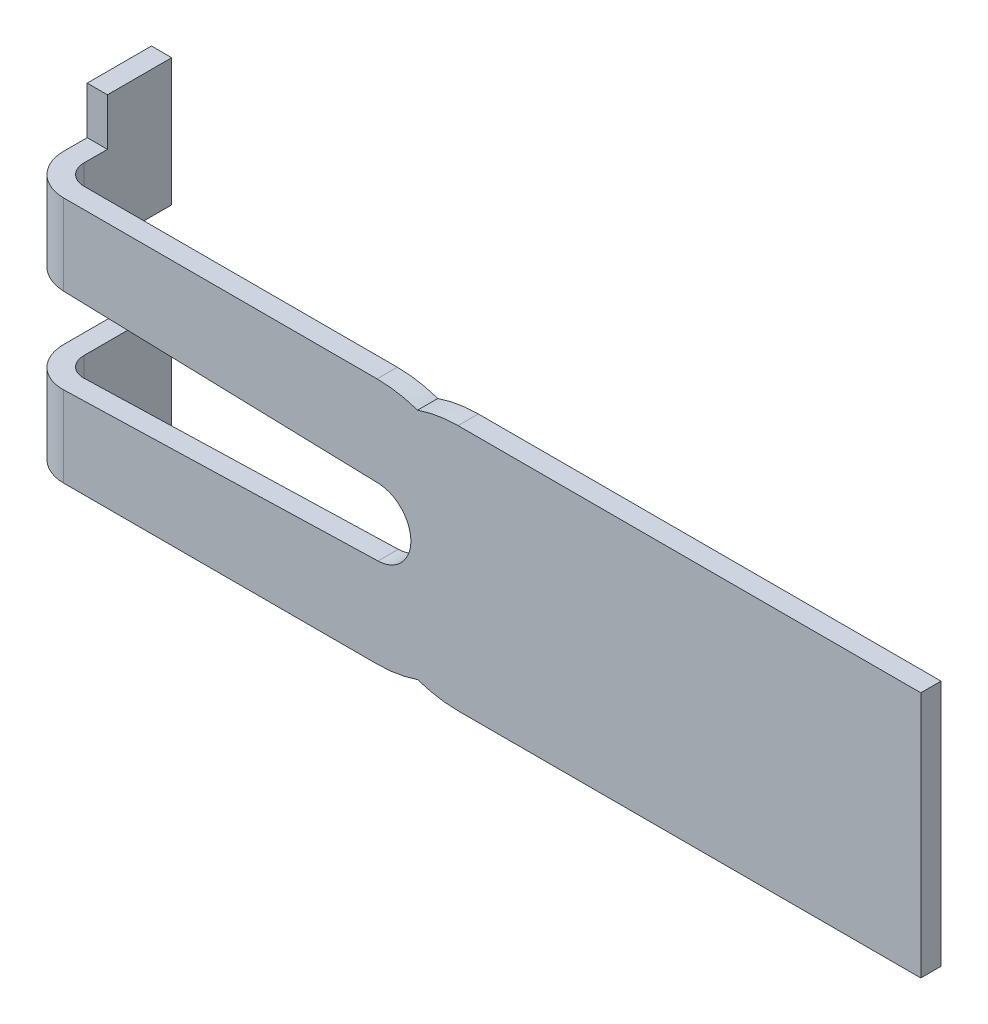
ISO-10303-21;
HEADER;
FILE_DESCRIPTION(('STEP AP214'),'2;1');
FILE_NAME('part.step','',(''),(''),'','','');
FILE_SCHEMA(('AUTOMOTIVE_DESIGN { 1 0 10303 214 1 1 1 1 }'));
ENDSEC;
DATA;
#1=APPLICATION_CONTEXT('core data for automotive mechanical design processes');
#2=APPLICATION_PROTOCOL_DEFINITION('international standard','automotive_design',2000,#1);
#3=PRODUCT_CONTEXT('',#1,'mechanical');
#4=PRODUCT('Part','Part','',(#3));
#5=PRODUCT_RELATED_PRODUCT_CATEGORY('part','',(#4));
#6=PRODUCT_DEFINITION_FORMATION('','',#4);
#7=PRODUCT_DEFINITION_CONTEXT('part definition',#1,'design');
#8=PRODUCT_DEFINITION('design','',#6,#7);
#9=PRODUCT_DEFINITION_SHAPE('','',#8);
#10=(LENGTH_UNIT() NAMED_UNIT(*) SI_UNIT(.MILLI.,.METRE.));
#11=(NAMED_UNIT(*) PLANE_ANGLE_UNIT() SI_UNIT($,.RADIAN.));
#12=(NAMED_UNIT(*) SI_UNIT($,.STERADIAN.) SOLID_ANGLE_UNIT());
#13=UNCERTAINTY_MEASURE_WITH_UNIT(LENGTH_MEASURE(1.E-05),#10,'distance_accuracy_value','');
#14=(GEOMETRIC_REPRESENTATION_CONTEXT(3) GLOBAL_UNCERTAINTY_ASSIGNED_CONTEXT((#13)) GLOBAL_UNIT_ASSIGNED_CONTEXT((#10,
#11,#12)) REPRESENTATION_CONTEXT('',''));
#15=CARTESIAN_POINT('',(0.,0.,0.));
#16=DIRECTION('',(0.,0.,1.));
#17=DIRECTION('',(1.,0.,0.));
#18=AXIS2_PLACEMENT_3D('',#15,#16,#17);
#19=CARTESIAN_POINT('',(0.300000000000002,1.83,1.9));
#20=DIRECTION('',(0.,0.,-1.));
#21=DIRECTION('',(-1.,0.,0.));
#22=AXIS2_PLACEMENT_3D('',#19,#20,#21);
#23=PLANE('',#22);
#24=CARTESIAN_POINT('',(6.14330650942758,0.,1.9));
#25=DIRECTION('',(0.,0.,-1.));
#26=DIRECTION('',(1.,0.,0.));
#27=AXIS2_PLACEMENT_3D('',#24,#25,#26);
#28=CIRCLE('',#27,1.83);
#29=CARTESIAN_POINT('',(6.14330650942758,-1.83,1.9));
#30=VERTEX_POINT('',#29);
#31=CARTESIAN_POINT('',(5.54330650942758,-1.72884354410687,1.9));
#32=VERTEX_POINT('',#31);
#33=EDGE_CURVE('E211',#30,#32,#28,.T.);
#34=ORIENTED_EDGE('',*,*,#33,.F.);
#35=DIRECTION('',(1.,0.,0.));
#36=VECTOR('',#35,1.);
#37=CARTESIAN_POINT('',(0.300000000000002,-1.83,1.9));
#38=LINE('',#37,#36);
#39=CARTESIAN_POINT('',(13.,-1.83,1.9));
#40=VERTEX_POINT('',#39);
#41=EDGE_CURVE('E444',#30,#40,#38,.T.);
#42=ORIENTED_EDGE('',*,*,#41,.T.);
#43=DIRECTION('',(0.,-1.,0.));
#44=VECTOR('',#43,1.);
#45=CARTESIAN_POINT('',(13.,1.83,1.9));
#46=LINE('',#45,#44);
#47=CARTESIAN_POINT('',(13.,1.83,1.9));
#48=VERTEX_POINT('',#47);
#49=EDGE_CURVE('E332',#48,#40,#46,.T.);
#50=ORIENTED_EDGE('',*,*,#49,.F.);
#51=DIRECTION('',(1.,0.,0.));
#52=VECTOR('',#51,1.);
#53=CARTESIAN_POINT('',(0.300000000000002,1.83,1.9));
#54=LINE('',#53,#52);
#55=CARTESIAN_POINT('',(6.14330650942758,1.83,1.9));
#56=VERTEX_POINT('',#55);
#57=EDGE_CURVE('E310',#56,#48,#54,.T.);
#58=ORIENTED_EDGE('',*,*,#57,.F.);
#59=CARTESIAN_POINT('',(6.14330650942758,0.,1.9));
#60=DIRECTION('',(0.,0.,-1.));
#61=DIRECTION('',(1.,0.,0.));
#62=AXIS2_PLACEMENT_3D('',#59,#60,#61);
#63=CIRCLE('',#62,1.83);
#64=CARTESIAN_POINT('',(5.54330650942758,1.72884354410687,1.9));
#65=VERTEX_POINT('',#64);
#66=EDGE_CURVE('E235',#65,#56,#63,.T.);
#67=ORIENTED_EDGE('',*,*,#66,.F.);
#68=CARTESIAN_POINT('',(4.94330650942758,0.,1.9));
#69=DIRECTION('',(0.,0.,-1.));
#70=DIRECTION('',(1.,0.,0.));
#71=AXIS2_PLACEMENT_3D('',#68,#69,#70);
#72=CIRCLE('',#71,1.83);
#73=CARTESIAN_POINT('',(4.94330650942758,1.83,1.9));
#74=VERTEX_POINT('',#73);
#75=EDGE_CURVE('E237',#74,#65,#72,.T.);
#76=ORIENTED_EDGE('',*,*,#75,.F.);
#77=CARTESIAN_POINT('',(0.300000000000002,1.83,1.9));
#78=VERTEX_POINT('',#77);
#79=EDGE_CURVE('E311',#78,#74,#54,.T.);
#80=ORIENTED_EDGE('',*,*,#79,.F.);
#81=DIRECTION('',(0.,-1.,0.));
#82=VECTOR('',#81,1.);
#83=CARTESIAN_POINT('',(0.300000000000002,1.83,1.9));
#84=LINE('',#83,#82);
#85=CARTESIAN_POINT('',(0.300000000000002,0.632858603308353,1.9));
#86=VERTEX_POINT('',#85);
#87=EDGE_CURVE('E358',#78,#86,#84,.T.);
#88=ORIENTED_EDGE('',*,*,#87,.T.);
#89=DIRECTION('',(-0.999592155917968,0.0285573427907472,0.));
#90=VECTOR('',#89,1.);
#91=CARTESIAN_POINT('',(-0.3,0.65,1.9));
#92=LINE('',#91,#90);
#93=CARTESIAN_POINT('',(4.95758518082296,0.499796077958984,1.9));
#94=VERTEX_POINT('',#93);
#95=EDGE_CURVE('E419',#94,#86,#92,.T.);
#96=ORIENTED_EDGE('',*,*,#95,.F.);
#97=CARTESIAN_POINT('',(4.94330650942758,0.,1.9));
#98=DIRECTION('',(0.,0.,1.));
#99=DIRECTION('',(1.,0.,0.));
#100=AXIS2_PLACEMENT_3D('',#97,#98,#99);
#101=CIRCLE('',#100,0.5);
#102=CARTESIAN_POINT('',(4.95758518082296,-0.499796077958984,1.9));
#103=VERTEX_POINT('',#102);
#104=EDGE_CURVE('E417',#103,#94,#101,.T.);
#105=ORIENTED_EDGE('',*,*,#104,.F.);
#106=DIRECTION('',(0.999592155917968,0.0285573427907472,0.));
#107=VECTOR('',#106,1.);
#108=CARTESIAN_POINT('',(-0.3,-0.65,1.9));
#109=LINE('',#108,#107);
#110=CARTESIAN_POINT('',(0.3,-0.632858603308353,1.9));
#111=VERTEX_POINT('',#110);
#112=EDGE_CURVE('E415',#111,#103,#109,.T.);
#113=ORIENTED_EDGE('',*,*,#112,.F.);
#114=CARTESIAN_POINT('',(0.300000000000002,-1.83,1.9));
#115=VERTEX_POINT('',#114);
#116=EDGE_CURVE('E360',#111,#115,#84,.T.);
#117=ORIENTED_EDGE('',*,*,#116,.T.);
#118=CARTESIAN_POINT('',(4.94330650942758,-1.83,1.9));
#119=VERTEX_POINT('',#118);
#120=EDGE_CURVE('E227',#115,#119,#38,.T.);
#121=ORIENTED_EDGE('',*,*,#120,.T.);
#122=CARTESIAN_POINT('',(4.94330650942758,0.,1.9));
#123=DIRECTION('',(0.,0.,-1.));
#124=DIRECTION('',(1.,0.,0.));
#125=AXIS2_PLACEMENT_3D('',#122,#123,#124);
#126=CIRCLE('',#125,1.83);
#127=EDGE_CURVE('E51',#32,#119,#126,.T.);
#128=ORIENTED_EDGE('',*,*,#127,.F.);
#129=EDGE_LOOP('',(#34,#42,#50,#58,#67,#76,#80,#88,#96,#105,#113,#117,#121,#128));
#130=FACE_BOUND('',#129,.T.);
#131=ADVANCED_FACE('F35',(#130),#23,.F.);
#132=CARTESIAN_POINT('',(0.300000000000002,1.83,1.6));
#133=DIRECTION('',(0.,0.,-1.));
#134=DIRECTION('',(-1.,0.,0.));
#135=AXIS2_PLACEMENT_3D('',#132,#133,#134);
#136=PLANE('',#135);
#137=DIRECTION('',(1.,0.,0.));
#138=VECTOR('',#137,1.);
#139=CARTESIAN_POINT('',(0.300000000000002,-1.83,1.6));
#140=LINE('',#139,#138);
#141=CARTESIAN_POINT('',(6.14330650942758,-1.83,1.6));
#142=VERTEX_POINT('',#141);
#143=CARTESIAN_POINT('',(13.,-1.83,1.6));
#144=VERTEX_POINT('',#143);
#145=EDGE_CURVE('E449',#142,#144,#140,.T.);
#146=ORIENTED_EDGE('',*,*,#145,.F.);
#147=CARTESIAN_POINT('',(6.14330650942758,0.,1.6));
#148=DIRECTION('',(0.,0.,-1.));
#149=DIRECTION('',(-1.,0.,0.));
#150=AXIS2_PLACEMENT_3D('',#147,#148,#149);
#151=CIRCLE('',#150,1.83);
#152=CARTESIAN_POINT('',(5.54330650942758,-1.72884354410687,1.6));
#153=VERTEX_POINT('',#152);
#154=EDGE_CURVE('E233',#142,#153,#151,.T.);
#155=ORIENTED_EDGE('',*,*,#154,.T.);
#156=CARTESIAN_POINT('',(4.94330650942758,0.,1.6));
#157=DIRECTION('',(0.,0.,-1.));
#158=DIRECTION('',(-1.,0.,0.));
#159=AXIS2_PLACEMENT_3D('',#156,#157,#158);
#160=CIRCLE('',#159,1.83);
#161=CARTESIAN_POINT('',(4.94330650942758,-1.83,1.6));
#162=VERTEX_POINT('',#161);
#163=EDGE_CURVE('E222',#153,#162,#160,.T.);
#164=ORIENTED_EDGE('',*,*,#163,.T.);
#165=CARTESIAN_POINT('',(0.300000000000002,-1.83,1.6));
#166=VERTEX_POINT('',#165);
#167=EDGE_CURVE('E450',#166,#162,#140,.T.);
#168=ORIENTED_EDGE('',*,*,#167,.F.);
#169=DIRECTION('',(0.,-1.,0.));
#170=VECTOR('',#169,1.);
#171=CARTESIAN_POINT('',(0.300000000000002,1.83,1.6));
#172=LINE('',#171,#170);
#173=CARTESIAN_POINT('',(0.300000000000002,-0.632858603308353,1.6));
#174=VERTEX_POINT('',#173);
#175=EDGE_CURVE('E341',#174,#166,#172,.T.);
#176=ORIENTED_EDGE('',*,*,#175,.F.);
#177=DIRECTION('',(0.999592155917968,0.0285573427907472,0.));
#178=VECTOR('',#177,1.);
#179=CARTESIAN_POINT('',(0.37030401260542,-0.63085008835988,1.6));
#180=LINE('',#179,#178);
#181=CARTESIAN_POINT('',(4.95758518082296,-0.499796077958984,1.6));
#182=VERTEX_POINT('',#181);
#183=EDGE_CURVE('E441',#174,#182,#180,.T.);
#184=ORIENTED_EDGE('',*,*,#183,.T.);
#185=CARTESIAN_POINT('',(4.94330650942758,0.,1.6));
#186=DIRECTION('',(0.,0.,-1.));
#187=DIRECTION('',(-1.,0.,0.));
#188=AXIS2_PLACEMENT_3D('',#185,#186,#187);
#189=CIRCLE('',#188,0.5);
#190=CARTESIAN_POINT('',(4.95758518082296,0.499796077958984,1.6));
#191=VERTEX_POINT('',#190);
#192=EDGE_CURVE('E11',#182,#191,#189,.F.);
#193=ORIENTED_EDGE('',*,*,#192,.T.);
#194=DIRECTION('',(-0.999592155917968,0.0285573427907472,0.));
#195=VECTOR('',#194,1.);
#196=CARTESIAN_POINT('',(0.265826765803601,0.633834898247682,1.6));
#197=LINE('',#196,#195);
#198=CARTESIAN_POINT('',(0.300000000000002,0.632858603308353,1.6));
#199=VERTEX_POINT('',#198);
#200=EDGE_CURVE('E386',#191,#199,#197,.T.);
#201=ORIENTED_EDGE('',*,*,#200,.T.);
#202=CARTESIAN_POINT('',(0.300000000000002,1.83,1.6));
#203=VERTEX_POINT('',#202);
#204=EDGE_CURVE('E338',#203,#199,#172,.T.);
#205=ORIENTED_EDGE('',*,*,#204,.F.);
#206=DIRECTION('',(1.,0.,0.));
#207=VECTOR('',#206,1.);
#208=CARTESIAN_POINT('',(0.300000000000002,1.83,1.6));
#209=LINE('',#208,#207);
#210=CARTESIAN_POINT('',(4.94330650942758,1.83,1.6));
#211=VERTEX_POINT('',#210);
#212=EDGE_CURVE('E318',#203,#211,#209,.T.);
#213=ORIENTED_EDGE('',*,*,#212,.T.);
#214=CARTESIAN_POINT('',(4.94330650942758,0.,1.6));
#215=DIRECTION('',(0.,0.,-1.));
#216=DIRECTION('',(-1.,0.,0.));
#217=AXIS2_PLACEMENT_3D('',#214,#215,#216);
#218=CIRCLE('',#217,1.83);
#219=CARTESIAN_POINT('',(5.54330650942758,1.72884354410687,1.6));
#220=VERTEX_POINT('',#219);
#221=EDGE_CURVE('E59',#211,#220,#218,.T.);
#222=ORIENTED_EDGE('',*,*,#221,.T.);
#223=CARTESIAN_POINT('',(6.14330650942758,0.,1.6));
#224=DIRECTION('',(0.,0.,-1.));
#225=DIRECTION('',(-1.,0.,0.));
#226=AXIS2_PLACEMENT_3D('',#223,#224,#225);
#227=CIRCLE('',#226,1.83);
#228=CARTESIAN_POINT('',(6.14330650942758,1.83,1.6));
#229=VERTEX_POINT('',#228);
#230=EDGE_CURVE('E246',#220,#229,#227,.T.);
#231=ORIENTED_EDGE('',*,*,#230,.T.);
#232=CARTESIAN_POINT('',(13.,1.83,1.6));
#233=VERTEX_POINT('',#232);
#234=EDGE_CURVE('E317',#229,#233,#209,.T.);
#235=ORIENTED_EDGE('',*,*,#234,.T.);
#236=DIRECTION('',(0.,-1.,0.));
#237=VECTOR('',#236,1.);
#238=CARTESIAN_POINT('',(13.,1.83,1.6));
#239=LINE('',#238,#237);
#240=EDGE_CURVE('E335',#233,#144,#239,.T.);
#241=ORIENTED_EDGE('',*,*,#240,.T.);
#242=EDGE_LOOP('',(#146,#155,#164,#168,#176,#184,#193,#201,#205,#213,#222,#231,#235,#241));
#243=FACE_BOUND('',#242,.T.);
#244=ADVANCED_FACE('F384',(#243),#136,.T.);
#245=CARTESIAN_POINT('',(0.3,-1.83,1.3));
#246=DIRECTION('',(0.,1.,0.));
#247=DIRECTION('',(0.,0.,1.));
#248=AXIS2_PLACEMENT_3D('',#245,#246,#247);
#249=PLANE('',#248);
#250=DIRECTION('',(0.,0.,-1.));
#251=VECTOR('',#250,1.);
#252=CARTESIAN_POINT('',(4.94330650942758,-1.83,1.9));
#253=LINE('',#252,#251);
#254=EDGE_CURVE('E223',#119,#162,#253,.T.);
#255=ORIENTED_EDGE('',*,*,#254,.F.);
#256=ORIENTED_EDGE('',*,*,#120,.F.);
#257=CARTESIAN_POINT('',(0.3,-1.83,1.3));
#258=DIRECTION('',(0.,1.,0.));
#259=DIRECTION('',(1.,0.,0.));
#260=AXIS2_PLACEMENT_3D('',#257,#258,#259);
#261=CIRCLE('',#260,0.6);
#262=CARTESIAN_POINT('',(-0.3,-1.83,1.3));
#263=VERTEX_POINT('',#262);
#264=EDGE_CURVE('E303',#263,#115,#261,.T.);
#265=ORIENTED_EDGE('',*,*,#264,.F.);
#266=DIRECTION('',(0.,0.,1.));
#267=VECTOR('',#266,1.);
#268=CARTESIAN_POINT('',(-0.3,-1.83,0.));
#269=LINE('',#268,#267);
#270=CARTESIAN_POINT('',(-0.3,-1.83,0.952232616032771));
#271=VERTEX_POINT('',#270);
#272=EDGE_CURVE('E301',#271,#263,#269,.T.);
#273=ORIENTED_EDGE('',*,*,#272,.F.);
#274=DIRECTION('',(1.,0.,0.));
#275=VECTOR('',#274,1.);
#276=CARTESIAN_POINT('',(0.,-1.83,0.952232616032771));
#277=LINE('',#276,#275);
#278=CARTESIAN_POINT('',(0.,-1.83,0.952232616032771));
#279=VERTEX_POINT('',#278);
#280=EDGE_CURVE('E249',#271,#279,#277,.T.);
#281=ORIENTED_EDGE('',*,*,#280,.T.);
#282=DIRECTION('',(0.,0.,1.));
#283=VECTOR('',#282,1.);
#284=CARTESIAN_POINT('',(0.,-1.83,0.));
#285=LINE('',#284,#283);
#286=CARTESIAN_POINT('',(0.,-1.83,1.3));
#287=VERTEX_POINT('',#286);
#288=EDGE_CURVE('E258',#279,#287,#285,.T.);
#289=ORIENTED_EDGE('',*,*,#288,.T.);
#290=CARTESIAN_POINT('',(0.3,-1.83,1.3));
#291=DIRECTION('',(0.,1.,0.));
#292=DIRECTION('',(0.,0.,-1.));
#293=AXIS2_PLACEMENT_3D('',#290,#291,#292);
#294=CIRCLE('',#293,0.3);
#295=EDGE_CURVE('E452',#287,#166,#294,.T.);
#296=ORIENTED_EDGE('',*,*,#295,.T.);
#297=ORIENTED_EDGE('',*,*,#167,.T.);
#298=EDGE_LOOP('',(#255,#256,#265,#273,#281,#289,#296,#297));
#299=FACE_BOUND('',#298,.T.);
#300=ADVANCED_FACE('F458',(#299),#249,.F.);
#301=CARTESIAN_POINT('',(0.3,1.83,1.3));
#302=DIRECTION('',(0.,1.,0.));
#303=DIRECTION('',(0.,0.,1.));
#304=AXIS2_PLACEMENT_3D('',#301,#302,#303);
#305=PLANE('',#304);
#306=ORIENTED_EDGE('',*,*,#79,.T.);
#307=DIRECTION('',(0.,0.,-1.));
#308=VECTOR('',#307,1.);
#309=CARTESIAN_POINT('',(4.94330650942758,1.83,1.9));
#310=LINE('',#309,#308);
#311=EDGE_CURVE('E241',#74,#211,#310,.T.);
#312=ORIENTED_EDGE('',*,*,#311,.T.);
#313=ORIENTED_EDGE('',*,*,#212,.F.);
#314=CARTESIAN_POINT('',(0.3,1.83,1.3));
#315=DIRECTION('',(0.,1.,0.));
#316=DIRECTION('',(0.,0.,-1.));
#317=AXIS2_PLACEMENT_3D('',#314,#315,#316);
#318=CIRCLE('',#317,0.3);
#319=CARTESIAN_POINT('',(0.,1.83,1.3));
#320=VERTEX_POINT('',#319);
#321=EDGE_CURVE('E321',#320,#203,#318,.T.);
#322=ORIENTED_EDGE('',*,*,#321,.F.);
#323=DIRECTION('',(0.,0.,1.));
#324=VECTOR('',#323,1.);
#325=CARTESIAN_POINT('',(0.,1.83,0.));
#326=LINE('',#325,#324);
#327=CARTESIAN_POINT('',(0.,1.83,0.952232616032771));
#328=VERTEX_POINT('',#327);
#329=EDGE_CURVE('E324',#328,#320,#326,.T.);
#330=ORIENTED_EDGE('',*,*,#329,.F.);
#331=DIRECTION('',(1.,0.,0.));
#332=VECTOR('',#331,1.);
#333=CARTESIAN_POINT('',(0.,1.83,0.952232616032771));
#334=LINE('',#333,#332);
#335=CARTESIAN_POINT('',(-0.3,1.83,0.952232616032771));
#336=VERTEX_POINT('',#335);
#337=EDGE_CURVE('E263',#336,#328,#334,.T.);
#338=ORIENTED_EDGE('',*,*,#337,.F.);
#339=DIRECTION('',(0.,0.,1.));
#340=VECTOR('',#339,1.);
#341=CARTESIAN_POINT('',(-0.3,1.83,0.));
#342=LINE('',#341,#340);
#343=CARTESIAN_POINT('',(-0.3,1.83,1.3));
#344=VERTEX_POINT('',#343);
#345=EDGE_CURVE('E287',#336,#344,#342,.T.);
#346=ORIENTED_EDGE('',*,*,#345,.T.);
#347=CARTESIAN_POINT('',(0.3,1.83,1.3));
#348=DIRECTION('',(0.,1.,0.));
#349=DIRECTION('',(1.,0.,0.));
#350=AXIS2_PLACEMENT_3D('',#347,#348,#349);
#351=CIRCLE('',#350,0.6);
#352=EDGE_CURVE('E361',#344,#78,#351,.T.);
#353=ORIENTED_EDGE('',*,*,#352,.T.);
#354=EDGE_LOOP('',(#306,#312,#313,#322,#330,#338,#346,#353));
#355=FACE_BOUND('',#354,.T.);
#356=ADVANCED_FACE('F367',(#355),#305,.T.);
#357=CARTESIAN_POINT('',(0.3,1.83,1.3));
#358=DIRECTION('',(0.,-1.,0.));
#359=DIRECTION('',(0.,0.,-1.));
#360=AXIS2_PLACEMENT_3D('',#357,#358,#359);
#361=CYLINDRICAL_SURFACE('',#360,0.3);
#362=DIRECTION('',(0.,-1.,0.));
#363=VECTOR('',#362,1.);
#364=CARTESIAN_POINT('',(0.,1.83,1.3));
#365=LINE('',#364,#363);
#366=CARTESIAN_POINT('',(0.,-0.641429301654177,1.3));
#367=VERTEX_POINT('',#366);
#368=EDGE_CURVE('E345',#367,#287,#365,.T.);
#369=ORIENTED_EDGE('',*,*,#368,.F.);
#370=CARTESIAN_POINT('',(0.3,-0.632858603308353,1.3));
#371=DIRECTION('',(-0.0285573427907472,0.999592155917968,0.));
#372=DIRECTION('',(-0.999592155917968,-0.0285573427907472,0.));
#373=AXIS2_PLACEMENT_3D('',#370,#371,#372);
#374=ELLIPSE('',#373,0.300122403146008,0.3);
#375=EDGE_CURVE('E438',#367,#174,#374,.T.);
#376=ORIENTED_EDGE('',*,*,#375,.T.);
#377=ORIENTED_EDGE('',*,*,#175,.T.);
#378=ORIENTED_EDGE('',*,*,#295,.F.);
#379=EDGE_LOOP('',(#369,#376,#377,#378));
#380=FACE_BOUND('',#379,.T.);
#381=ADVANCED_FACE('F465',(#380),#361,.F.);
#382=ORIENTED_EDGE('',*,*,#204,.T.);
#383=CARTESIAN_POINT('',(0.3,0.632858603308353,1.3));
#384=DIRECTION('',(-0.0285573427907472,-0.999592155917968,0.));
#385=DIRECTION('',(0.999592155917968,-0.0285573427907472,0.));
#386=AXIS2_PLACEMENT_3D('',#383,#384,#385);
#387=ELLIPSE('',#386,0.300122403146008,0.3);
#388=CARTESIAN_POINT('',(0.,0.641429301654177,1.3));
#389=VERTEX_POINT('',#388);
#390=EDGE_CURVE('E391',#199,#389,#387,.T.);
#391=ORIENTED_EDGE('',*,*,#390,.T.);
#392=EDGE_CURVE('E342',#320,#389,#365,.T.);
#393=ORIENTED_EDGE('',*,*,#392,.F.);
#394=ORIENTED_EDGE('',*,*,#321,.T.);
#395=EDGE_LOOP('',(#382,#391,#393,#394));
#396=FACE_BOUND('',#395,.T.);
#397=ADVANCED_FACE('F389',(#396),#361,.F.);
#398=CARTESIAN_POINT('',(0.,1.83,0.));
#399=DIRECTION('',(1.,0.,0.));
#400=DIRECTION('',(0.,0.,-1.));
#401=AXIS2_PLACEMENT_3D('',#398,#399,#400);
#402=PLANE('',#401);
#403=DIRECTION('',(0.,-1.,0.));
#404=VECTOR('',#403,1.);
#405=CARTESIAN_POINT('',(0.,1.83,0.));
#406=LINE('',#405,#404);
#407=CARTESIAN_POINT('',(0.,-0.641429301654177,0.));
#408=VERTEX_POINT('',#407);
#409=CARTESIAN_POINT('',(0.,-2.53,0.));
#410=VERTEX_POINT('',#409);
#411=EDGE_CURVE('E349',#408,#410,#406,.T.);
#412=ORIENTED_EDGE('',*,*,#411,.F.);
#413=DIRECTION('',(0.,0.,1.));
#414=VECTOR('',#413,1.);
#415=CARTESIAN_POINT('',(0.,-0.641429301654177,0.));
#416=LINE('',#415,#414);
#417=EDGE_CURVE('E435',#408,#367,#416,.T.);
#418=ORIENTED_EDGE('',*,*,#417,.T.);
#419=ORIENTED_EDGE('',*,*,#368,.T.);
#420=ORIENTED_EDGE('',*,*,#288,.F.);
#421=DIRECTION('',(0.,1.,0.));
#422=VECTOR('',#421,1.);
#423=CARTESIAN_POINT('',(0.,-2.53,0.952232616032771));
#424=LINE('',#423,#422);
#425=CARTESIAN_POINT('',(0.,-2.53,0.952232616032771));
#426=VERTEX_POINT('',#425);
#427=EDGE_CURVE('E261',#426,#279,#424,.T.);
#428=ORIENTED_EDGE('',*,*,#427,.F.);
#429=DIRECTION('',(0.,0.,-1.));
#430=VECTOR('',#429,1.);
#431=CARTESIAN_POINT('',(0.,-2.53,0.));
#432=LINE('',#431,#430);
#433=EDGE_CURVE('E252',#426,#410,#432,.T.);
#434=ORIENTED_EDGE('',*,*,#433,.T.);
#435=EDGE_LOOP('',(#412,#418,#419,#420,#428,#434));
#436=FACE_BOUND('',#435,.T.);
#437=ADVANCED_FACE('F463',(#436),#402,.T.);
#438=ORIENTED_EDGE('',*,*,#392,.T.);
#439=DIRECTION('',(0.,0.,-1.));
#440=VECTOR('',#439,1.);
#441=CARTESIAN_POINT('',(0.,0.641429301654177,0.));
#442=LINE('',#441,#440);
#443=CARTESIAN_POINT('',(0.,0.641429301654177,0.));
#444=VERTEX_POINT('',#443);
#445=EDGE_CURVE('E431',#389,#444,#442,.T.);
#446=ORIENTED_EDGE('',*,*,#445,.T.);
#447=CARTESIAN_POINT('',(0.,2.53,0.));
#448=VERTEX_POINT('',#447);
#449=EDGE_CURVE('E346',#448,#444,#406,.T.);
#450=ORIENTED_EDGE('',*,*,#449,.F.);
#451=DIRECTION('',(0.,0.,-1.));
#452=VECTOR('',#451,1.);
#453=CARTESIAN_POINT('',(0.,2.53,0.));
#454=LINE('',#453,#452);
#455=CARTESIAN_POINT('',(0.,2.53,0.952232616032771));
#456=VERTEX_POINT('',#455);
#457=EDGE_CURVE('E281',#456,#448,#454,.T.);
#458=ORIENTED_EDGE('',*,*,#457,.F.);
#459=DIRECTION('',(0.,-1.,0.));
#460=VECTOR('',#459,1.);
#461=CARTESIAN_POINT('',(0.,2.53,0.952232616032771));
#462=LINE('',#461,#460);
#463=EDGE_CURVE('E290',#456,#328,#462,.T.);
#464=ORIENTED_EDGE('',*,*,#463,.T.);
#465=ORIENTED_EDGE('',*,*,#329,.T.);
#466=EDGE_LOOP('',(#438,#446,#450,#458,#464,#465));
#467=FACE_BOUND('',#466,.T.);
#468=ADVANCED_FACE('F398',(#467),#402,.T.);
#469=CARTESIAN_POINT('',(-0.3,1.83,0.));
#470=DIRECTION('',(0.,0.,-1.));
#471=DIRECTION('',(-1.,0.,0.));
#472=AXIS2_PLACEMENT_3D('',#469,#470,#471);
#473=PLANE('',#472);
#474=DIRECTION('',(0.,-1.,0.));
#475=VECTOR('',#474,1.);
#476=CARTESIAN_POINT('',(-0.3,1.83,0.));
#477=LINE('',#476,#475);
#478=CARTESIAN_POINT('',(-0.3,-0.65,0.));
#479=VERTEX_POINT('',#478);
#480=CARTESIAN_POINT('',(-0.3,-2.53,0.));
#481=VERTEX_POINT('',#480);
#482=EDGE_CURVE('E353',#479,#481,#477,.T.);
#483=ORIENTED_EDGE('',*,*,#482,.F.);
#484=DIRECTION('',(0.999592155917968,0.0285573427907472,0.));
#485=VECTOR('',#484,1.);
#486=CARTESIAN_POINT('',(-0.3,-0.65,0.));
#487=LINE('',#486,#485);
#488=EDGE_CURVE('E299',#479,#408,#487,.T.);
#489=ORIENTED_EDGE('',*,*,#488,.T.);
#490=ORIENTED_EDGE('',*,*,#411,.T.);
#491=DIRECTION('',(-1.,0.,0.));
#492=VECTOR('',#491,1.);
#493=CARTESIAN_POINT('',(0.,-2.53,0.));
#494=LINE('',#493,#492);
#495=EDGE_CURVE('E266',#410,#481,#494,.T.);
#496=ORIENTED_EDGE('',*,*,#495,.T.);
#497=EDGE_LOOP('',(#483,#489,#490,#496));
#498=FACE_BOUND('',#497,.T.);
#499=ADVANCED_FACE('F478',(#498),#473,.T.);
#500=ORIENTED_EDGE('',*,*,#449,.T.);
#501=DIRECTION('',(-0.999592155917968,0.0285573427907472,0.));
#502=VECTOR('',#501,1.);
#503=CARTESIAN_POINT('',(-0.3,0.65,0.));
#504=LINE('',#503,#502);
#505=CARTESIAN_POINT('',(-0.3,0.65,0.));
#506=VERTEX_POINT('',#505);
#507=EDGE_CURVE('E412',#444,#506,#504,.T.);
#508=ORIENTED_EDGE('',*,*,#507,.T.);
#509=CARTESIAN_POINT('',(-0.3,2.53,0.));
#510=VERTEX_POINT('',#509);
#511=EDGE_CURVE('E350',#510,#506,#477,.T.);
#512=ORIENTED_EDGE('',*,*,#511,.F.);
#513=DIRECTION('',(-1.,0.,0.));
#514=VECTOR('',#513,1.);
#515=CARTESIAN_POINT('',(0.,2.53,0.));
#516=LINE('',#515,#514);
#517=EDGE_CURVE('E404',#448,#510,#516,.T.);
#518=ORIENTED_EDGE('',*,*,#517,.F.);
#519=EDGE_LOOP('',(#500,#508,#512,#518));
#520=FACE_BOUND('',#519,.T.);
#521=ADVANCED_FACE('F665',(#520),#473,.T.);
#522=CARTESIAN_POINT('',(-0.3,1.83,0.));
#523=DIRECTION('',(1.,0.,0.));
#524=DIRECTION('',(0.,0.,-1.));
#525=AXIS2_PLACEMENT_3D('',#522,#523,#524);
#526=PLANE('',#525);
#527=DIRECTION('',(0.,0.,-1.));
#528=VECTOR('',#527,1.);
#529=CARTESIAN_POINT('',(-0.3,-0.65,1.9));
#530=LINE('',#529,#528);
#531=CARTESIAN_POINT('',(-0.3,-0.65,1.3));
#532=VERTEX_POINT('',#531);
#533=EDGE_CURVE('E428',#532,#479,#530,.T.);
#534=ORIENTED_EDGE('',*,*,#533,.T.);
#535=ORIENTED_EDGE('',*,*,#482,.T.);
#536=DIRECTION('',(0.,0.,1.));
#537=VECTOR('',#536,1.);
#538=CARTESIAN_POINT('',(-0.3,-2.53,0.));
#539=LINE('',#538,#537);
#540=CARTESIAN_POINT('',(-0.3,-2.53,0.952232616032771));
#541=VERTEX_POINT('',#540);
#542=EDGE_CURVE('E271',#481,#541,#539,.T.);
#543=ORIENTED_EDGE('',*,*,#542,.T.);
#544=DIRECTION('',(0.,1.,0.));
#545=VECTOR('',#544,1.);
#546=CARTESIAN_POINT('',(-0.3,-2.53,0.952232616032771));
#547=LINE('',#546,#545);
#548=EDGE_CURVE('E264',#541,#271,#547,.T.);
#549=ORIENTED_EDGE('',*,*,#548,.T.);
#550=ORIENTED_EDGE('',*,*,#272,.T.);
#551=DIRECTION('',(0.,-1.,0.));
#552=VECTOR('',#551,1.);
#553=CARTESIAN_POINT('',(-0.3,1.83,1.3));
#554=LINE('',#553,#552);
#555=EDGE_CURVE('E357',#532,#263,#554,.T.);
#556=ORIENTED_EDGE('',*,*,#555,.F.);
#557=EDGE_LOOP('',(#534,#535,#543,#549,#550,#556));
#558=FACE_BOUND('',#557,.T.);
#559=ADVANCED_FACE('F475',(#558),#526,.F.);
#560=DIRECTION('',(0.,0.,-1.));
#561=VECTOR('',#560,1.);
#562=CARTESIAN_POINT('',(-0.3,0.65,1.9));
#563=LINE('',#562,#561);
#564=CARTESIAN_POINT('',(-0.3,0.65,1.3));
#565=VERTEX_POINT('',#564);
#566=EDGE_CURVE('E372',#565,#506,#563,.T.);
#567=ORIENTED_EDGE('',*,*,#566,.F.);
#568=EDGE_CURVE('E354',#344,#565,#554,.T.);
#569=ORIENTED_EDGE('',*,*,#568,.F.);
#570=ORIENTED_EDGE('',*,*,#345,.F.);
#571=DIRECTION('',(0.,-1.,0.));
#572=VECTOR('',#571,1.);
#573=CARTESIAN_POINT('',(-0.3,2.53,0.952232616032771));
#574=LINE('',#573,#572);
#575=CARTESIAN_POINT('',(-0.3,2.53,0.952232616032771));
#576=VERTEX_POINT('',#575);
#577=EDGE_CURVE('E293',#576,#336,#574,.T.);
#578=ORIENTED_EDGE('',*,*,#577,.F.);
#579=DIRECTION('',(0.,0.,1.));
#580=VECTOR('',#579,1.);
#581=CARTESIAN_POINT('',(-0.3,2.53,0.));
#582=LINE('',#581,#580);
#583=EDGE_CURVE('E405',#510,#576,#582,.T.);
#584=ORIENTED_EDGE('',*,*,#583,.F.);
#585=ORIENTED_EDGE('',*,*,#511,.T.);
#586=EDGE_LOOP('',(#567,#569,#570,#578,#584,#585));
#587=FACE_BOUND('',#586,.T.);
#588=ADVANCED_FACE('F371',(#587),#526,.F.);
#589=CARTESIAN_POINT('',(0.3,1.83,1.3));
#590=DIRECTION('',(0.,-1.,0.));
#591=DIRECTION('',(0.,0.,-1.));
#592=AXIS2_PLACEMENT_3D('',#589,#590,#591);
#593=CYLINDRICAL_SURFACE('',#592,0.6);
#594=CARTESIAN_POINT('',(0.3,-0.632858603308353,1.3));
#595=DIRECTION('',(-0.0285573427907472,0.999592155917968,0.));
#596=DIRECTION('',(-0.999592155917968,-0.0285573427907472,0.));
#597=AXIS2_PLACEMENT_3D('',#594,#595,#596);
#598=ELLIPSE('',#597,0.600244806292016,0.6);
#599=EDGE_CURVE('E43',#532,#111,#598,.T.);
#600=ORIENTED_EDGE('',*,*,#599,.F.);
#601=ORIENTED_EDGE('',*,*,#555,.T.);
#602=ORIENTED_EDGE('',*,*,#264,.T.);
#603=ORIENTED_EDGE('',*,*,#116,.F.);
#604=EDGE_LOOP('',(#600,#601,#602,#603));
#605=FACE_BOUND('',#604,.T.);
#606=ADVANCED_FACE('F473',(#605),#593,.T.);
#607=CARTESIAN_POINT('',(0.3,0.632858603308353,1.3));
#608=DIRECTION('',(-0.0285573427907472,-0.999592155917968,0.));
#609=DIRECTION('',(0.999592155917968,-0.0285573427907472,0.));
#610=AXIS2_PLACEMENT_3D('',#607,#608,#609);
#611=ELLIPSE('',#610,0.600244806292016,0.6);
#612=EDGE_CURVE('E330',#86,#565,#611,.T.);
#613=ORIENTED_EDGE('',*,*,#612,.F.);
#614=ORIENTED_EDGE('',*,*,#87,.F.);
#615=ORIENTED_EDGE('',*,*,#352,.F.);
#616=ORIENTED_EDGE('',*,*,#568,.T.);
#617=EDGE_LOOP('',(#613,#614,#615,#616));
#618=FACE_BOUND('',#617,.T.);
#619=ADVANCED_FACE('F375',(#618),#593,.T.);
#620=CARTESIAN_POINT('',(13.,1.83,1.6));
#621=DIRECTION('',(1.,0.,0.));
#622=DIRECTION('',(0.,0.,-1.));
#623=AXIS2_PLACEMENT_3D('',#620,#621,#622);
#624=PLANE('',#623);
#625=DIRECTION('',(0.,0.,1.));
#626=VECTOR('',#625,1.);
#627=CARTESIAN_POINT('',(13.,-1.83,1.6));
#628=LINE('',#627,#626);
#629=EDGE_CURVE('E446',#144,#40,#628,.T.);
#630=ORIENTED_EDGE('',*,*,#629,.F.);
#631=ORIENTED_EDGE('',*,*,#240,.F.);
#632=DIRECTION('',(0.,0.,1.));
#633=VECTOR('',#632,1.);
#634=CARTESIAN_POINT('',(13.,1.83,1.6));
#635=LINE('',#634,#633);
#636=EDGE_CURVE('E314',#233,#48,#635,.T.);
#637=ORIENTED_EDGE('',*,*,#636,.T.);
#638=ORIENTED_EDGE('',*,*,#49,.T.);
#639=EDGE_LOOP('',(#630,#631,#637,#638));
#640=FACE_BOUND('',#639,.T.);
#641=ADVANCED_FACE('F509',(#640),#624,.T.);
#642=DIRECTION('',(0.,0.,-1.));
#643=VECTOR('',#642,1.);
#644=CARTESIAN_POINT('',(6.14330650942758,1.83,1.9));
#645=LINE('',#644,#643);
#646=EDGE_CURVE('E243',#56,#229,#645,.T.);
#647=ORIENTED_EDGE('',*,*,#646,.F.);
#648=ORIENTED_EDGE('',*,*,#57,.T.);
#649=ORIENTED_EDGE('',*,*,#636,.F.);
#650=ORIENTED_EDGE('',*,*,#234,.F.);
#651=EDGE_LOOP('',(#647,#648,#649,#650));
#652=FACE_BOUND('',#651,.T.);
#653=ADVANCED_FACE('F511',(#652),#305,.T.);
#654=ORIENTED_EDGE('',*,*,#41,.F.);
#655=DIRECTION('',(0.,0.,-1.));
#656=VECTOR('',#655,1.);
#657=CARTESIAN_POINT('',(6.14330650942758,-1.83,1.9));
#658=LINE('',#657,#656);
#659=EDGE_CURVE('E216',#30,#142,#658,.T.);
#660=ORIENTED_EDGE('',*,*,#659,.T.);
#661=ORIENTED_EDGE('',*,*,#145,.T.);
#662=ORIENTED_EDGE('',*,*,#629,.T.);
#663=EDGE_LOOP('',(#654,#660,#661,#662));
#664=FACE_BOUND('',#663,.T.);
#665=ADVANCED_FACE('F506',(#664),#249,.F.);
#666=CARTESIAN_POINT('',(-0.3,-0.65,1.9));
#667=DIRECTION('',(-0.0285573427907472,0.999592155917968,0.));
#668=DIRECTION('',(-0.999592155917968,-0.0285573427907472,0.));
#669=AXIS2_PLACEMENT_3D('',#666,#667,#668);
#670=PLANE('',#669);
#671=ORIENTED_EDGE('',*,*,#375,.F.);
#672=ORIENTED_EDGE('',*,*,#417,.F.);
#673=ORIENTED_EDGE('',*,*,#488,.F.);
#674=ORIENTED_EDGE('',*,*,#533,.F.);
#675=ORIENTED_EDGE('',*,*,#599,.T.);
#676=ORIENTED_EDGE('',*,*,#112,.T.);
#677=DIRECTION('',(0.,0.,-1.));
#678=VECTOR('',#677,1.);
#679=CARTESIAN_POINT('',(4.95758518082296,-0.499796077958984,1.9));
#680=LINE('',#679,#678);
#681=EDGE_CURVE('E425',#103,#182,#680,.T.);
#682=ORIENTED_EDGE('',*,*,#681,.T.);
#683=ORIENTED_EDGE('',*,*,#183,.F.);
#684=EDGE_LOOP('',(#671,#672,#673,#674,#675,#676,#682,#683));
#685=FACE_BOUND('',#684,.T.);
#686=ADVANCED_FACE('F607',(#685),#670,.T.);
#687=CARTESIAN_POINT('',(-0.3,0.65,1.9));
#688=DIRECTION('',(-0.0285573427907472,-0.999592155917968,0.));
#689=DIRECTION('',(0.999592155917968,-0.0285573427907472,0.));
#690=AXIS2_PLACEMENT_3D('',#687,#688,#689);
#691=PLANE('',#690);
#692=DIRECTION('',(0.,0.,-1.));
#693=VECTOR('',#692,1.);
#694=CARTESIAN_POINT('',(4.95758518082296,0.499796077958984,1.9));
#695=LINE('',#694,#693);
#696=EDGE_CURVE('E422',#94,#191,#695,.T.);
#697=ORIENTED_EDGE('',*,*,#696,.F.);
#698=ORIENTED_EDGE('',*,*,#95,.T.);
#699=ORIENTED_EDGE('',*,*,#612,.T.);
#700=ORIENTED_EDGE('',*,*,#566,.T.);
#701=ORIENTED_EDGE('',*,*,#507,.F.);
#702=ORIENTED_EDGE('',*,*,#445,.F.);
#703=ORIENTED_EDGE('',*,*,#390,.F.);
#704=ORIENTED_EDGE('',*,*,#200,.F.);
#705=EDGE_LOOP('',(#697,#698,#699,#700,#701,#702,#703,#704));
#706=FACE_BOUND('',#705,.T.);
#707=ADVANCED_FACE('F596',(#706),#691,.T.);
#708=CARTESIAN_POINT('',(4.94330650942758,0.,1.9));
#709=DIRECTION('',(0.,0.,-1.));
#710=DIRECTION('',(-1.,0.,0.));
#711=AXIS2_PLACEMENT_3D('',#708,#709,#710);
#712=CYLINDRICAL_SURFACE('',#711,0.5);
#713=ORIENTED_EDGE('',*,*,#681,.F.);
#714=ORIENTED_EDGE('',*,*,#104,.T.);
#715=ORIENTED_EDGE('',*,*,#696,.T.);
#716=ORIENTED_EDGE('',*,*,#192,.F.);
#717=EDGE_LOOP('',(#713,#714,#715,#716));
#718=FACE_BOUND('',#717,.T.);
#719=ADVANCED_FACE('F586',(#718),#712,.F.);
#720=CARTESIAN_POINT('',(0.,2.53,0.952232616032771));
#721=DIRECTION('',(0.,0.,-1.));
#722=DIRECTION('',(-1.,0.,0.));
#723=AXIS2_PLACEMENT_3D('',#720,#721,#722);
#724=PLANE('',#723);
#725=ORIENTED_EDGE('',*,*,#337,.T.);
#726=ORIENTED_EDGE('',*,*,#463,.F.);
#727=DIRECTION('',(1.,0.,0.));
#728=VECTOR('',#727,1.);
#729=CARTESIAN_POINT('',(0.,2.53,0.952232616032771));
#730=LINE('',#729,#728);
#731=EDGE_CURVE('E294',#576,#456,#730,.T.);
#732=ORIENTED_EDGE('',*,*,#731,.F.);
#733=ORIENTED_EDGE('',*,*,#577,.T.);
#734=EDGE_LOOP('',(#725,#726,#732,#733));
#735=FACE_BOUND('',#734,.T.);
#736=ADVANCED_FACE('F395',(#735),#724,.F.);
#737=CARTESIAN_POINT('',(0.,2.53,0.));
#738=DIRECTION('',(0.,-1.,0.));
#739=DIRECTION('',(0.,0.,-1.));
#740=AXIS2_PLACEMENT_3D('',#737,#738,#739);
#741=PLANE('',#740);
#742=ORIENTED_EDGE('',*,*,#457,.T.);
#743=ORIENTED_EDGE('',*,*,#517,.T.);
#744=ORIENTED_EDGE('',*,*,#583,.T.);
#745=ORIENTED_EDGE('',*,*,#731,.T.);
#746=EDGE_LOOP('',(#742,#743,#744,#745));
#747=FACE_BOUND('',#746,.T.);
#748=ADVANCED_FACE('F488',(#747),#741,.F.);
#749=CARTESIAN_POINT('',(0.,-2.53,0.952232616032771));
#750=DIRECTION('',(0.,0.,1.));
#751=DIRECTION('',(1.,0.,0.));
#752=AXIS2_PLACEMENT_3D('',#749,#750,#751);
#753=PLANE('',#752);
#754=ORIENTED_EDGE('',*,*,#280,.F.);
#755=ORIENTED_EDGE('',*,*,#548,.F.);
#756=DIRECTION('',(1.,0.,0.));
#757=VECTOR('',#756,1.);
#758=CARTESIAN_POINT('',(0.,-2.53,0.952232616032771));
#759=LINE('',#758,#757);
#760=EDGE_CURVE('E276',#541,#426,#759,.T.);
#761=ORIENTED_EDGE('',*,*,#760,.T.);
#762=ORIENTED_EDGE('',*,*,#427,.T.);
#763=EDGE_LOOP('',(#754,#755,#761,#762));
#764=FACE_BOUND('',#763,.T.);
#765=ADVANCED_FACE('F486',(#764),#753,.T.);
#766=CARTESIAN_POINT('',(0.,-2.53,0.));
#767=DIRECTION('',(0.,1.,0.));
#768=DIRECTION('',(0.,0.,-1.));
#769=AXIS2_PLACEMENT_3D('',#766,#767,#768);
#770=PLANE('',#769);
#771=ORIENTED_EDGE('',*,*,#433,.F.);
#772=ORIENTED_EDGE('',*,*,#760,.F.);
#773=ORIENTED_EDGE('',*,*,#542,.F.);
#774=ORIENTED_EDGE('',*,*,#495,.F.);
#775=EDGE_LOOP('',(#771,#772,#773,#774));
#776=FACE_BOUND('',#775,.T.);
#777=ADVANCED_FACE('F484',(#776),#770,.F.);
#778=CARTESIAN_POINT('',(6.14330650942758,0.,1.9));
#779=DIRECTION('',(0.,0.,-1.));
#780=DIRECTION('',(-1.,0.,0.));
#781=AXIS2_PLACEMENT_3D('',#778,#779,#780);
#782=CYLINDRICAL_SURFACE('',#781,1.83);
#783=DIRECTION('',(0.,0.,-1.));
#784=VECTOR('',#783,1.);
#785=CARTESIAN_POINT('',(5.54330650942758,1.72884354410687,1.9));
#786=LINE('',#785,#784);
#787=EDGE_CURVE('E239',#65,#220,#786,.T.);
#788=ORIENTED_EDGE('',*,*,#787,.F.);
#789=ORIENTED_EDGE('',*,*,#66,.T.);
#790=ORIENTED_EDGE('',*,*,#646,.T.);
#791=ORIENTED_EDGE('',*,*,#230,.F.);
#792=EDGE_LOOP('',(#788,#789,#790,#791));
#793=FACE_BOUND('',#792,.T.);
#794=ADVANCED_FACE('F494',(#793),#782,.T.);
#795=CARTESIAN_POINT('',(4.94330650942758,0.,1.9));
#796=DIRECTION('',(0.,0.,-1.));
#797=DIRECTION('',(-1.,0.,0.));
#798=AXIS2_PLACEMENT_3D('',#795,#796,#797);
#799=CYLINDRICAL_SURFACE('',#798,1.83);
#800=ORIENTED_EDGE('',*,*,#311,.F.);
#801=ORIENTED_EDGE('',*,*,#75,.T.);
#802=ORIENTED_EDGE('',*,*,#787,.T.);
#803=ORIENTED_EDGE('',*,*,#221,.F.);
#804=EDGE_LOOP('',(#800,#801,#802,#803));
#805=FACE_BOUND('',#804,.T.);
#806=ADVANCED_FACE('F530',(#805),#799,.T.);
#807=CARTESIAN_POINT('',(6.14330650942758,0.,1.9));
#808=DIRECTION('',(0.,0.,-1.));
#809=DIRECTION('',(-1.,0.,0.));
#810=AXIS2_PLACEMENT_3D('',#807,#808,#809);
#811=CYLINDRICAL_SURFACE('',#810,1.83);
#812=ORIENTED_EDGE('',*,*,#659,.F.);
#813=ORIENTED_EDGE('',*,*,#33,.T.);
#814=DIRECTION('',(0.,0.,-1.));
#815=VECTOR('',#814,1.);
#816=CARTESIAN_POINT('',(5.54330650942758,-1.72884354410687,1.9));
#817=LINE('',#816,#815);
#818=EDGE_CURVE('E213',#32,#153,#817,.T.);
#819=ORIENTED_EDGE('',*,*,#818,.T.);
#820=ORIENTED_EDGE('',*,*,#154,.F.);
#821=EDGE_LOOP('',(#812,#813,#819,#820));
#822=FACE_BOUND('',#821,.T.);
#823=ADVANCED_FACE('F212',(#822),#811,.T.);
#824=CARTESIAN_POINT('',(4.94330650942758,0.,1.9));
#825=DIRECTION('',(0.,0.,-1.));
#826=DIRECTION('',(-1.,0.,0.));
#827=AXIS2_PLACEMENT_3D('',#824,#825,#826);
#828=CYLINDRICAL_SURFACE('',#827,1.83);
#829=ORIENTED_EDGE('',*,*,#818,.F.);
#830=ORIENTED_EDGE('',*,*,#127,.T.);
#831=ORIENTED_EDGE('',*,*,#254,.T.);
#832=ORIENTED_EDGE('',*,*,#163,.F.);
#833=EDGE_LOOP('',(#829,#830,#831,#832));
#834=FACE_BOUND('',#833,.T.);
#835=ADVANCED_FACE('F220',(#834),#828,.T.);
#836=CLOSED_SHELL('',(#131,#244,#300,#356,#381,#397,#437,#468,#499,#521,#559,#588,#606,#619,
#641,#653,#665,#686,#707,#719,#736,#748,#765,#777,#794,#806,#823,#835));
#837=MANIFOLD_SOLID_BREP('B2',#836);
#838=ADVANCED_BREP_SHAPE_REPRESENTATION('',(#18,#837),#14);
#839=SHAPE_DEFINITION_REPRESENTATION(#9,#838);
ENDSEC;
END-ISO-10303-21;
